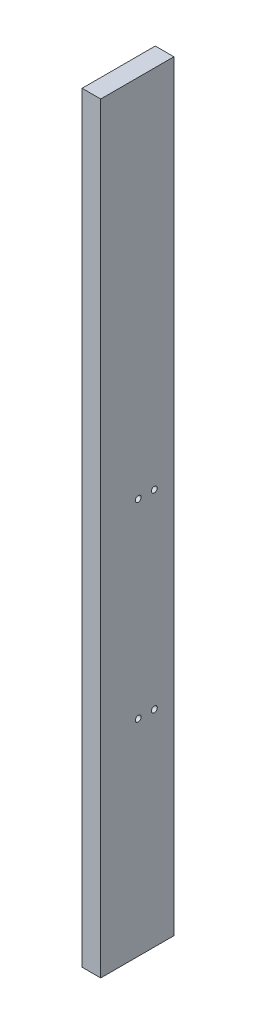
ISO-10303-21;
HEADER;
FILE_DESCRIPTION(('STEP AP214'),'2;1');
FILE_NAME('part.step','',(''),(''),'','','');
FILE_SCHEMA(('AUTOMOTIVE_DESIGN { 1 0 10303 214 1 1 1 1 }'));
ENDSEC;
DATA;
#1=APPLICATION_CONTEXT('core data for automotive mechanical design processes');
#2=APPLICATION_PROTOCOL_DEFINITION('international standard','automotive_design',2000,#1);
#3=PRODUCT_CONTEXT('',#1,'mechanical');
#4=PRODUCT('Part','Part','',(#3));
#5=PRODUCT_RELATED_PRODUCT_CATEGORY('part','',(#4));
#6=PRODUCT_DEFINITION_FORMATION('','',#4);
#7=PRODUCT_DEFINITION_CONTEXT('part definition',#1,'design');
#8=PRODUCT_DEFINITION('design','',#6,#7);
#9=PRODUCT_DEFINITION_SHAPE('','',#8);
#10=(LENGTH_UNIT() NAMED_UNIT(*) SI_UNIT(.MILLI.,.METRE.));
#11=(NAMED_UNIT(*) PLANE_ANGLE_UNIT() SI_UNIT($,.RADIAN.));
#12=(NAMED_UNIT(*) SI_UNIT($,.STERADIAN.) SOLID_ANGLE_UNIT());
#13=UNCERTAINTY_MEASURE_WITH_UNIT(LENGTH_MEASURE(1.E-05),#10,'distance_accuracy_value','');
#14=(GEOMETRIC_REPRESENTATION_CONTEXT(3) GLOBAL_UNCERTAINTY_ASSIGNED_CONTEXT((#13)) GLOBAL_UNIT_ASSIGNED_CONTEXT((#10,
#11,#12)) REPRESENTATION_CONTEXT('',''));
#15=CARTESIAN_POINT('',(0.,0.,0.));
#16=DIRECTION('',(0.,0.,1.));
#17=DIRECTION('',(1.,0.,0.));
#18=AXIS2_PLACEMENT_3D('',#15,#16,#17);
#19=CARTESIAN_POINT('',(12.7,260.,-25.));
#20=DIRECTION('',(0.,0.,1.));
#21=DIRECTION('',(0.,-1.,0.));
#22=AXIS2_PLACEMENT_3D('',#19,#20,#21);
#23=PLANE('',#22);
#24=DIRECTION('',(0.,1.,0.));
#25=VECTOR('',#24,1.);
#26=CARTESIAN_POINT('',(0.,260.,-25.));
#27=LINE('',#26,#25);
#28=CARTESIAN_POINT('',(0.,-260.,-25.));
#29=VERTEX_POINT('',#28);
#30=CARTESIAN_POINT('',(0.,260.,-25.));
#31=VERTEX_POINT('',#30);
#32=EDGE_CURVE('E97',#29,#31,#27,.T.);
#33=ORIENTED_EDGE('',*,*,#32,.T.);
#34=DIRECTION('',(-1.,0.,0.));
#35=VECTOR('',#34,1.);
#36=CARTESIAN_POINT('',(12.7,260.,-25.));
#37=LINE('',#36,#35);
#38=CARTESIAN_POINT('',(12.7,260.,-25.));
#39=VERTEX_POINT('',#38);
#40=EDGE_CURVE('E11',#39,#31,#37,.T.);
#41=ORIENTED_EDGE('',*,*,#40,.F.);
#42=DIRECTION('',(0.,1.,0.));
#43=VECTOR('',#42,1.);
#44=CARTESIAN_POINT('',(12.7,260.,-25.));
#45=LINE('',#44,#43);
#46=CARTESIAN_POINT('',(12.7,-260.,-25.));
#47=VERTEX_POINT('',#46);
#48=EDGE_CURVE('E85',#47,#39,#45,.T.);
#49=ORIENTED_EDGE('',*,*,#48,.F.);
#50=DIRECTION('',(-1.,0.,0.));
#51=VECTOR('',#50,1.);
#52=CARTESIAN_POINT('',(12.7,-260.,-25.));
#53=LINE('',#52,#51);
#54=EDGE_CURVE('E93',#47,#29,#53,.T.);
#55=ORIENTED_EDGE('',*,*,#54,.T.);
#56=EDGE_LOOP('',(#33,#41,#49,#55));
#57=FACE_BOUND('',#56,.T.);
#58=ADVANCED_FACE('F34',(#57),#23,.F.);
#59=CARTESIAN_POINT('',(12.7,260.,25.));
#60=DIRECTION('',(0.,-1.,0.));
#61=DIRECTION('',(0.,0.,-1.));
#62=AXIS2_PLACEMENT_3D('',#59,#60,#61);
#63=PLANE('',#62);
#64=DIRECTION('',(0.,0.,1.));
#65=VECTOR('',#64,1.);
#66=CARTESIAN_POINT('',(0.,260.,25.));
#67=LINE('',#66,#65);
#68=CARTESIAN_POINT('',(0.,260.,25.));
#69=VERTEX_POINT('',#68);
#70=EDGE_CURVE('E89',#31,#69,#67,.T.);
#71=ORIENTED_EDGE('',*,*,#70,.T.);
#72=DIRECTION('',(-1.,0.,0.));
#73=VECTOR('',#72,1.);
#74=CARTESIAN_POINT('',(12.7,260.,25.));
#75=LINE('',#74,#73);
#76=CARTESIAN_POINT('',(12.7,260.,25.));
#77=VERTEX_POINT('',#76);
#78=EDGE_CURVE('E42',#77,#69,#75,.T.);
#79=ORIENTED_EDGE('',*,*,#78,.F.);
#80=DIRECTION('',(0.,0.,1.));
#81=VECTOR('',#80,1.);
#82=CARTESIAN_POINT('',(12.7,260.,25.));
#83=LINE('',#82,#81);
#84=EDGE_CURVE('E80',#39,#77,#83,.T.);
#85=ORIENTED_EDGE('',*,*,#84,.F.);
#86=ORIENTED_EDGE('',*,*,#40,.T.);
#87=EDGE_LOOP('',(#71,#79,#85,#86));
#88=FACE_BOUND('',#87,.T.);
#89=ADVANCED_FACE('F88',(#88),#63,.F.);
#90=CARTESIAN_POINT('',(12.7,260.,25.));
#91=DIRECTION('',(0.,0.,-1.));
#92=DIRECTION('',(0.,1.,0.));
#93=AXIS2_PLACEMENT_3D('',#90,#91,#92);
#94=PLANE('',#93);
#95=DIRECTION('',(0.,-1.,0.));
#96=VECTOR('',#95,1.);
#97=CARTESIAN_POINT('',(0.,260.,25.));
#98=LINE('',#97,#96);
#99=CARTESIAN_POINT('',(0.,-260.,25.));
#100=VERTEX_POINT('',#99);
#101=EDGE_CURVE('E67',#69,#100,#98,.T.);
#102=ORIENTED_EDGE('',*,*,#101,.T.);
#103=DIRECTION('',(-1.,0.,0.));
#104=VECTOR('',#103,1.);
#105=CARTESIAN_POINT('',(12.7,-260.,25.));
#106=LINE('',#105,#104);
#107=CARTESIAN_POINT('',(12.7,-260.,25.));
#108=VERTEX_POINT('',#107);
#109=EDGE_CURVE('E90',#108,#100,#106,.T.);
#110=ORIENTED_EDGE('',*,*,#109,.F.);
#111=DIRECTION('',(0.,-1.,0.));
#112=VECTOR('',#111,1.);
#113=CARTESIAN_POINT('',(12.7,260.,25.));
#114=LINE('',#113,#112);
#115=EDGE_CURVE('E83',#77,#108,#114,.T.);
#116=ORIENTED_EDGE('',*,*,#115,.F.);
#117=ORIENTED_EDGE('',*,*,#78,.T.);
#118=EDGE_LOOP('',(#102,#110,#116,#117));
#119=FACE_BOUND('',#118,.T.);
#120=ADVANCED_FACE('F91',(#119),#94,.F.);
#121=CARTESIAN_POINT('',(12.7,-260.,25.));
#122=DIRECTION('',(0.,1.,0.));
#123=DIRECTION('',(0.,0.,1.));
#124=AXIS2_PLACEMENT_3D('',#121,#122,#123);
#125=PLANE('',#124);
#126=DIRECTION('',(0.,0.,-1.));
#127=VECTOR('',#126,1.);
#128=CARTESIAN_POINT('',(0.,-260.,25.));
#129=LINE('',#128,#127);
#130=EDGE_CURVE('E73',#100,#29,#129,.T.);
#131=ORIENTED_EDGE('',*,*,#130,.T.);
#132=ORIENTED_EDGE('',*,*,#54,.F.);
#133=DIRECTION('',(0.,0.,-1.));
#134=VECTOR('',#133,1.);
#135=CARTESIAN_POINT('',(12.7,-260.,25.));
#136=LINE('',#135,#134);
#137=EDGE_CURVE('E50',#108,#47,#136,.T.);
#138=ORIENTED_EDGE('',*,*,#137,.F.);
#139=ORIENTED_EDGE('',*,*,#109,.T.);
#140=EDGE_LOOP('',(#131,#132,#138,#139));
#141=FACE_BOUND('',#140,.T.);
#142=ADVANCED_FACE('F105',(#141),#125,.F.);
#143=CARTESIAN_POINT('',(12.7,0.,0.));
#144=DIRECTION('',(1.,0.,0.));
#145=DIRECTION('',(0.,0.,-1.));
#146=AXIS2_PLACEMENT_3D('',#143,#144,#145);
#147=PLANE('',#146);
#148=CARTESIAN_POINT('',(12.7,10.6091400350149,-0.649999999999606));
#149=DIRECTION('',(-1.,0.,0.));
#150=DIRECTION('',(0.,0.,1.));
#151=AXIS2_PLACEMENT_3D('',#148,#149,#150);
#152=CIRCLE('',#151,2.);
#153=CARTESIAN_POINT('',(12.7,10.6091400350149,1.35000000000039));
#154=VERTEX_POINT('',#153);
#155=EDGE_CURVE('E114',#154,#154,#152,.T.);
#156=ORIENTED_EDGE('',*,*,#155,.T.);
#157=EDGE_LOOP('',(#156));
#158=FACE_BOUND('',#157,.T.);
#159=CARTESIAN_POINT('',(12.7,-119.390859964985,-11.6499999999997));
#160=DIRECTION('',(-1.,0.,0.));
#161=DIRECTION('',(0.,0.,1.));
#162=AXIS2_PLACEMENT_3D('',#159,#160,#161);
#163=CIRCLE('',#162,2.);
#164=CARTESIAN_POINT('',(12.7,-119.390859964985,-9.64999999999967));
#165=VERTEX_POINT('',#164);
#166=EDGE_CURVE('E120',#165,#165,#163,.T.);
#167=ORIENTED_EDGE('',*,*,#166,.T.);
#168=EDGE_LOOP('',(#167));
#169=FACE_BOUND('',#168,.T.);
#170=CARTESIAN_POINT('',(12.7,-119.390859964985,-0.649999999999665));
#171=DIRECTION('',(-1.,0.,0.));
#172=DIRECTION('',(0.,0.,1.));
#173=AXIS2_PLACEMENT_3D('',#170,#171,#172);
#174=CIRCLE('',#173,2.);
#175=CARTESIAN_POINT('',(12.7,-119.390859964985,1.35000000000034));
#176=VERTEX_POINT('',#175);
#177=EDGE_CURVE('E121',#176,#176,#174,.T.);
#178=ORIENTED_EDGE('',*,*,#177,.T.);
#179=EDGE_LOOP('',(#178));
#180=FACE_BOUND('',#179,.T.);
#181=CARTESIAN_POINT('',(12.7,10.6091400350149,-11.6499999999996));
#182=DIRECTION('',(-1.,0.,0.));
#183=DIRECTION('',(0.,0.,1.));
#184=AXIS2_PLACEMENT_3D('',#181,#182,#183);
#185=CIRCLE('',#184,2.);
#186=CARTESIAN_POINT('',(12.7,10.6091400350149,-9.64999999999961));
#187=VERTEX_POINT('',#186);
#188=EDGE_CURVE('E100',#187,#187,#185,.T.);
#189=ORIENTED_EDGE('',*,*,#188,.T.);
#190=EDGE_LOOP('',(#189));
#191=FACE_BOUND('',#190,.T.);
#192=ORIENTED_EDGE('',*,*,#48,.T.);
#193=ORIENTED_EDGE('',*,*,#84,.T.);
#194=ORIENTED_EDGE('',*,*,#115,.T.);
#195=ORIENTED_EDGE('',*,*,#137,.T.);
#196=EDGE_LOOP('',(#192,#193,#194,#195));
#197=FACE_BOUND('',#196,.T.);
#198=ADVANCED_FACE('F81',(#158,#169,#180,#191,#197),#147,.T.);
#199=CARTESIAN_POINT('',(0.,0.,0.));
#200=DIRECTION('',(1.,0.,0.));
#201=DIRECTION('',(0.,0.,-1.));
#202=AXIS2_PLACEMENT_3D('',#199,#200,#201);
#203=PLANE('',#202);
#204=CARTESIAN_POINT('',(0.,10.6091400350149,-0.649999999999606));
#205=DIRECTION('',(-1.,0.,0.));
#206=DIRECTION('',(0.,0.,1.));
#207=AXIS2_PLACEMENT_3D('',#204,#205,#206);
#208=CIRCLE('',#207,2.);
#209=CARTESIAN_POINT('',(0.,10.6091400350149,1.35000000000039));
#210=VERTEX_POINT('',#209);
#211=EDGE_CURVE('E124',#210,#210,#208,.T.);
#212=ORIENTED_EDGE('',*,*,#211,.F.);
#213=EDGE_LOOP('',(#212));
#214=FACE_BOUND('',#213,.T.);
#215=CARTESIAN_POINT('',(0.,-119.390859964985,-11.6499999999997));
#216=DIRECTION('',(-1.,0.,0.));
#217=DIRECTION('',(0.,0.,1.));
#218=AXIS2_PLACEMENT_3D('',#215,#216,#217);
#219=CIRCLE('',#218,2.);
#220=CARTESIAN_POINT('',(0.,-119.390859964985,-9.64999999999967));
#221=VERTEX_POINT('',#220);
#222=EDGE_CURVE('E117',#221,#221,#219,.T.);
#223=ORIENTED_EDGE('',*,*,#222,.F.);
#224=EDGE_LOOP('',(#223));
#225=FACE_BOUND('',#224,.T.);
#226=CARTESIAN_POINT('',(0.,-119.390859964985,-0.649999999999665));
#227=DIRECTION('',(-1.,0.,0.));
#228=DIRECTION('',(0.,0.,1.));
#229=AXIS2_PLACEMENT_3D('',#226,#227,#228);
#230=CIRCLE('',#229,2.);
#231=CARTESIAN_POINT('',(0.,-119.390859964985,1.35000000000034));
#232=VERTEX_POINT('',#231);
#233=EDGE_CURVE('E129',#232,#232,#230,.T.);
#234=ORIENTED_EDGE('',*,*,#233,.F.);
#235=EDGE_LOOP('',(#234));
#236=FACE_BOUND('',#235,.T.);
#237=CARTESIAN_POINT('',(0.,10.6091400350149,-11.6499999999996));
#238=DIRECTION('',(-1.,0.,0.));
#239=DIRECTION('',(0.,0.,1.));
#240=AXIS2_PLACEMENT_3D('',#237,#238,#239);
#241=CIRCLE('',#240,2.);
#242=CARTESIAN_POINT('',(0.,10.6091400350149,-9.64999999999961));
#243=VERTEX_POINT('',#242);
#244=EDGE_CURVE('E111',#243,#243,#241,.T.);
#245=ORIENTED_EDGE('',*,*,#244,.F.);
#246=EDGE_LOOP('',(#245));
#247=FACE_BOUND('',#246,.T.);
#248=ORIENTED_EDGE('',*,*,#32,.F.);
#249=ORIENTED_EDGE('',*,*,#130,.F.);
#250=ORIENTED_EDGE('',*,*,#101,.F.);
#251=ORIENTED_EDGE('',*,*,#70,.F.);
#252=EDGE_LOOP('',(#248,#249,#250,#251));
#253=FACE_BOUND('',#252,.T.);
#254=ADVANCED_FACE('F108',(#214,#225,#236,#247,#253),#203,.F.);
#255=CARTESIAN_POINT('',(12.7,10.6091400350149,-11.6499999999996));
#256=DIRECTION('',(-1.,0.,0.));
#257=DIRECTION('',(0.,0.,1.));
#258=AXIS2_PLACEMENT_3D('',#255,#256,#257);
#259=CYLINDRICAL_SURFACE('',#258,2.);
#260=ORIENTED_EDGE('',*,*,#188,.F.);
#261=EDGE_LOOP('',(#260));
#262=FACE_BOUND('',#261,.T.);
#263=ORIENTED_EDGE('',*,*,#244,.T.);
#264=EDGE_LOOP('',(#263));
#265=FACE_BOUND('',#264,.T.);
#266=ADVANCED_FACE('F141',(#262,#265),#259,.F.);
#267=CARTESIAN_POINT('',(12.7,-119.390859964985,-0.649999999999665));
#268=DIRECTION('',(-1.,0.,0.));
#269=DIRECTION('',(0.,0.,1.));
#270=AXIS2_PLACEMENT_3D('',#267,#268,#269);
#271=CYLINDRICAL_SURFACE('',#270,2.);
#272=ORIENTED_EDGE('',*,*,#177,.F.);
#273=EDGE_LOOP('',(#272));
#274=FACE_BOUND('',#273,.T.);
#275=ORIENTED_EDGE('',*,*,#233,.T.);
#276=EDGE_LOOP('',(#275));
#277=FACE_BOUND('',#276,.T.);
#278=ADVANCED_FACE('F137',(#274,#277),#271,.F.);
#279=CARTESIAN_POINT('',(12.7,-119.390859964985,-11.6499999999997));
#280=DIRECTION('',(-1.,0.,0.));
#281=DIRECTION('',(0.,0.,1.));
#282=AXIS2_PLACEMENT_3D('',#279,#280,#281);
#283=CYLINDRICAL_SURFACE('',#282,2.);
#284=ORIENTED_EDGE('',*,*,#166,.F.);
#285=EDGE_LOOP('',(#284));
#286=FACE_BOUND('',#285,.T.);
#287=ORIENTED_EDGE('',*,*,#222,.T.);
#288=EDGE_LOOP('',(#287));
#289=FACE_BOUND('',#288,.T.);
#290=ADVANCED_FACE('F140',(#286,#289),#283,.F.);
#291=CARTESIAN_POINT('',(12.7,10.6091400350149,-0.649999999999606));
#292=DIRECTION('',(-1.,0.,0.));
#293=DIRECTION('',(0.,0.,1.));
#294=AXIS2_PLACEMENT_3D('',#291,#292,#293);
#295=CYLINDRICAL_SURFACE('',#294,2.);
#296=ORIENTED_EDGE('',*,*,#155,.F.);
#297=EDGE_LOOP('',(#296));
#298=FACE_BOUND('',#297,.T.);
#299=ORIENTED_EDGE('',*,*,#211,.T.);
#300=EDGE_LOOP('',(#299));
#301=FACE_BOUND('',#300,.T.);
#302=ADVANCED_FACE('F179',(#298,#301),#295,.F.);
#303=CLOSED_SHELL('',(#58,#89,#120,#142,#198,#254,#266,#278,#290,#302));
#304=MANIFOLD_SOLID_BREP('B2',#303);
#305=ADVANCED_BREP_SHAPE_REPRESENTATION('',(#18,#304),#14);
#306=SHAPE_DEFINITION_REPRESENTATION(#9,#305);
ENDSEC;
END-ISO-10303-21;
